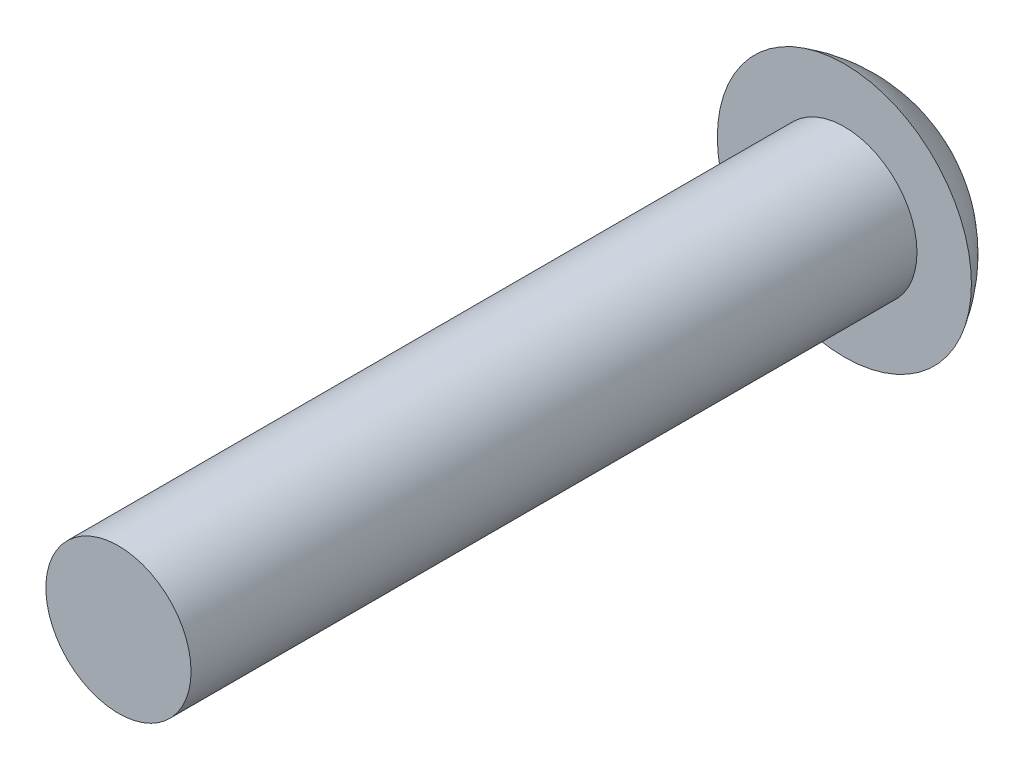
ISO-10303-21;
HEADER;
FILE_DESCRIPTION(('STEP AP214'),'2;1');
FILE_NAME('part.step','',(''),(''),'','','');
FILE_SCHEMA(('AUTOMOTIVE_DESIGN { 1 0 10303 214 1 1 1 1 }'));
ENDSEC;
DATA;
#1=APPLICATION_CONTEXT('core data for automotive mechanical design processes');
#2=APPLICATION_PROTOCOL_DEFINITION('international standard','automotive_design',2000,#1);
#3=PRODUCT_CONTEXT('',#1,'mechanical');
#4=PRODUCT('Part','Part','',(#3));
#5=PRODUCT_RELATED_PRODUCT_CATEGORY('part','',(#4));
#6=PRODUCT_DEFINITION_FORMATION('','',#4);
#7=PRODUCT_DEFINITION_CONTEXT('part definition',#1,'design');
#8=PRODUCT_DEFINITION('design','',#6,#7);
#9=PRODUCT_DEFINITION_SHAPE('','',#8);
#10=(LENGTH_UNIT() NAMED_UNIT(*) SI_UNIT(.MILLI.,.METRE.));
#11=(NAMED_UNIT(*) PLANE_ANGLE_UNIT() SI_UNIT($,.RADIAN.));
#12=(NAMED_UNIT(*) SI_UNIT($,.STERADIAN.) SOLID_ANGLE_UNIT());
#13=UNCERTAINTY_MEASURE_WITH_UNIT(LENGTH_MEASURE(1.E-05),#10,'distance_accuracy_value','');
#14=(GEOMETRIC_REPRESENTATION_CONTEXT(3) GLOBAL_UNCERTAINTY_ASSIGNED_CONTEXT((#13)) GLOBAL_UNIT_ASSIGNED_CONTEXT((#10,
#11,#12)) REPRESENTATION_CONTEXT('',''));
#15=CARTESIAN_POINT('',(0.,0.,0.));
#16=DIRECTION('',(0.,0.,1.));
#17=DIRECTION('',(1.,0.,0.));
#18=AXIS2_PLACEMENT_3D('',#15,#16,#17);
#19=CARTESIAN_POINT('',(0.,0.,-17.9375));
#20=DIRECTION('',(0.,0.,1.));
#21=DIRECTION('',(1.,0.,0.));
#22=AXIS2_PLACEMENT_3D('',#19,#20,#21);
#23=SPHERICAL_SURFACE('',#22,4.0625);
#24=CARTESIAN_POINT('',(0.,0.,-20.));
#25=DIRECTION('',(0.,0.,1.));
#26=DIRECTION('',(1.,0.,0.));
#27=AXIS2_PLACEMENT_3D('',#24,#25,#26);
#28=CIRCLE('',#27,3.5);
#29=CARTESIAN_POINT('',(3.5,0.,-20.));
#30=VERTEX_POINT('',#29);
#31=EDGE_CURVE('E341',#30,#30,#28,.T.);
#32=ORIENTED_EDGE('',*,*,#31,.F.);
#33=EDGE_LOOP('',(#32));
#34=FACE_BOUND('',#33,.T.);
#35=CARTESIAN_POINT('',(-0.1,0.,-17.9375));
#36=DIRECTION('',(1.,0.,0.));
#37=DIRECTION('',(0.,1.,0.));
#38=AXIS2_PLACEMENT_3D('',#35,#36,#37);
#39=CIRCLE('',#38,4.06126904427668);
#40=CARTESIAN_POINT('',(-0.1,-0.1,-21.9975377153421));
#41=VERTEX_POINT('',#40);
#42=CARTESIAN_POINT('',(-0.1,-2.,-21.4721720144873));
#43=VERTEX_POINT('',#42);
#44=EDGE_CURVE('E375',#41,#43,#39,.F.);
#45=ORIENTED_EDGE('',*,*,#44,.T.);
#46=CARTESIAN_POINT('',(0.,-2.,-17.9375));
#47=DIRECTION('',(0.,1.,0.));
#48=DIRECTION('',(0.,0.,1.));
#49=AXIS2_PLACEMENT_3D('',#46,#47,#48);
#50=CIRCLE('',#49,3.53608628995391);
#51=CARTESIAN_POINT('',(0.0999999999999998,-2.,-21.4721720144873));
#52=VERTEX_POINT('',#51);
#53=EDGE_CURVE('E12',#43,#52,#50,.F.);
#54=ORIENTED_EDGE('',*,*,#53,.T.);
#55=CARTESIAN_POINT('',(0.1,0.,-17.9375));
#56=DIRECTION('',(1.,0.,0.));
#57=DIRECTION('',(0.,1.,0.));
#58=AXIS2_PLACEMENT_3D('',#55,#56,#57);
#59=CIRCLE('',#58,4.06126904427668);
#60=CARTESIAN_POINT('',(0.1,-0.1,-21.9975377153421));
#61=VERTEX_POINT('',#60);
#62=EDGE_CURVE('E168',#61,#52,#59,.F.);
#63=ORIENTED_EDGE('',*,*,#62,.F.);
#64=CARTESIAN_POINT('',(0.,-0.1,-17.9375));
#65=DIRECTION('',(0.,1.,0.));
#66=DIRECTION('',(-1.,0.,0.));
#67=AXIS2_PLACEMENT_3D('',#64,#65,#66);
#68=CIRCLE('',#67,4.06126904427668);
#69=CARTESIAN_POINT('',(2.,-0.1,-21.4721720144873));
#70=VERTEX_POINT('',#69);
#71=EDGE_CURVE('E386',#61,#70,#68,.F.);
#72=ORIENTED_EDGE('',*,*,#71,.T.);
#73=CARTESIAN_POINT('',(2.,0.,-17.9375));
#74=DIRECTION('',(-1.,0.,0.));
#75=DIRECTION('',(0.,0.,1.));
#76=AXIS2_PLACEMENT_3D('',#73,#74,#75);
#77=CIRCLE('',#76,3.53608628995391);
#78=CARTESIAN_POINT('',(2.,0.0999999999999998,-21.4721720144873));
#79=VERTEX_POINT('',#78);
#80=EDGE_CURVE('E382',#70,#79,#77,.F.);
#81=ORIENTED_EDGE('',*,*,#80,.T.);
#82=CARTESIAN_POINT('',(0.,0.1,-17.9375));
#83=DIRECTION('',(0.,1.,0.));
#84=DIRECTION('',(-1.,0.,0.));
#85=AXIS2_PLACEMENT_3D('',#82,#83,#84);
#86=CIRCLE('',#85,4.06126904427668);
#87=CARTESIAN_POINT('',(0.1,0.1,-21.9975377153421));
#88=VERTEX_POINT('',#87);
#89=EDGE_CURVE('E379',#88,#79,#86,.F.);
#90=ORIENTED_EDGE('',*,*,#89,.F.);
#91=CARTESIAN_POINT('',(0.1,0.,-17.9375));
#92=DIRECTION('',(-1.,0.,0.));
#93=DIRECTION('',(0.,0.,1.));
#94=AXIS2_PLACEMENT_3D('',#91,#92,#93);
#95=CIRCLE('',#94,4.06126904427668);
#96=CARTESIAN_POINT('',(0.1,2.,-21.4721720144873));
#97=VERTEX_POINT('',#96);
#98=EDGE_CURVE('E371',#88,#97,#95,.F.);
#99=ORIENTED_EDGE('',*,*,#98,.T.);
#100=CARTESIAN_POINT('',(0.,2.,-17.9375));
#101=DIRECTION('',(0.,-1.,0.));
#102=DIRECTION('',(0.,0.,-1.));
#103=AXIS2_PLACEMENT_3D('',#100,#101,#102);
#104=CIRCLE('',#103,3.53608628995391);
#105=CARTESIAN_POINT('',(-0.1,2.,-21.4721720144873));
#106=VERTEX_POINT('',#105);
#107=EDGE_CURVE('E367',#97,#106,#104,.F.);
#108=ORIENTED_EDGE('',*,*,#107,.T.);
#109=CARTESIAN_POINT('',(-0.1,0.,-17.9375));
#110=DIRECTION('',(-1.,0.,0.));
#111=DIRECTION('',(0.,0.,1.));
#112=AXIS2_PLACEMENT_3D('',#109,#110,#111);
#113=CIRCLE('',#112,4.06126904427668);
#114=CARTESIAN_POINT('',(-0.1,0.1,-21.9975377153421));
#115=VERTEX_POINT('',#114);
#116=EDGE_CURVE('E364',#115,#106,#113,.F.);
#117=ORIENTED_EDGE('',*,*,#116,.F.);
#118=CARTESIAN_POINT('',(0.,0.1,-17.9375));
#119=DIRECTION('',(0.,-1.,0.));
#120=DIRECTION('',(0.,0.,-1.));
#121=AXIS2_PLACEMENT_3D('',#118,#119,#120);
#122=CIRCLE('',#121,4.06126904427668);
#123=CARTESIAN_POINT('',(-2.,0.1,-21.4721720144873));
#124=VERTEX_POINT('',#123);
#125=EDGE_CURVE('E360',#115,#124,#122,.F.);
#126=ORIENTED_EDGE('',*,*,#125,.T.);
#127=CARTESIAN_POINT('',(-2.,0.,-17.9375));
#128=DIRECTION('',(1.,0.,0.));
#129=DIRECTION('',(0.,0.,-1.));
#130=AXIS2_PLACEMENT_3D('',#127,#128,#129);
#131=CIRCLE('',#130,3.53608628995391);
#132=CARTESIAN_POINT('',(-2.,-0.1,-21.4721720144873));
#133=VERTEX_POINT('',#132);
#134=EDGE_CURVE('E356',#124,#133,#131,.F.);
#135=ORIENTED_EDGE('',*,*,#134,.T.);
#136=CARTESIAN_POINT('',(0.,-0.1,-17.9375));
#137=DIRECTION('',(0.,-1.,0.));
#138=DIRECTION('',(0.,0.,-1.));
#139=AXIS2_PLACEMENT_3D('',#136,#137,#138);
#140=CIRCLE('',#139,4.06126904427668);
#141=EDGE_CURVE('E353',#41,#133,#140,.F.);
#142=ORIENTED_EDGE('',*,*,#141,.F.);
#143=EDGE_LOOP('',(#45,#54,#63,#72,#81,#90,#99,#108,#117,#126,#135,#142));
#144=FACE_BOUND('',#143,.T.);
#145=ADVANCED_FACE('F159',(#34,#144),#23,.T.);
#146=CARTESIAN_POINT('',(0.,0.,-20.));
#147=DIRECTION('',(0.,0.,1.));
#148=DIRECTION('',(1.,0.,0.));
#149=AXIS2_PLACEMENT_3D('',#146,#147,#148);
#150=CYLINDRICAL_SURFACE('',#149,2.);
#151=CARTESIAN_POINT('',(0.,0.,-20.));
#152=DIRECTION('',(0.,0.,1.));
#153=DIRECTION('',(1.,0.,0.));
#154=AXIS2_PLACEMENT_3D('',#151,#152,#153);
#155=CIRCLE('',#154,2.);
#156=CARTESIAN_POINT('',(2.,0.,-20.));
#157=VERTEX_POINT('',#156);
#158=EDGE_CURVE('E345',#157,#157,#155,.F.);
#159=ORIENTED_EDGE('',*,*,#158,.F.);
#160=EDGE_LOOP('',(#159));
#161=FACE_BOUND('',#160,.T.);
#162=CARTESIAN_POINT('',(0.,0.,0.));
#163=DIRECTION('',(0.,0.,1.));
#164=DIRECTION('',(1.,0.,0.));
#165=AXIS2_PLACEMENT_3D('',#162,#163,#164);
#166=CIRCLE('',#165,2.);
#167=CARTESIAN_POINT('',(2.,0.,0.));
#168=VERTEX_POINT('',#167);
#169=EDGE_CURVE('E349',#168,#168,#166,.T.);
#170=ORIENTED_EDGE('',*,*,#169,.F.);
#171=EDGE_LOOP('',(#170));
#172=FACE_BOUND('',#171,.T.);
#173=ADVANCED_FACE('F161',(#161,#172),#150,.T.);
#174=CARTESIAN_POINT('',(0.,0.,0.));
#175=DIRECTION('',(0.,0.,1.));
#176=DIRECTION('',(1.,0.,0.));
#177=AXIS2_PLACEMENT_3D('',#174,#175,#176);
#178=PLANE('',#177);
#179=ORIENTED_EDGE('',*,*,#169,.T.);
#180=EDGE_LOOP('',(#179));
#181=FACE_BOUND('',#180,.T.);
#182=ADVANCED_FACE('F437',(#181),#178,.T.);
#183=CARTESIAN_POINT('',(3.5,0.,-20.));
#184=DIRECTION('',(0.,0.,1.));
#185=DIRECTION('',(1.,0.,0.));
#186=AXIS2_PLACEMENT_3D('',#183,#184,#185);
#187=PLANE('',#186);
#188=ORIENTED_EDGE('',*,*,#158,.T.);
#189=EDGE_LOOP('',(#188));
#190=FACE_BOUND('',#189,.T.);
#191=ORIENTED_EDGE('',*,*,#31,.T.);
#192=EDGE_LOOP('',(#191));
#193=FACE_BOUND('',#192,.T.);
#194=ADVANCED_FACE('F429',(#190,#193),#187,.T.);
#195=CARTESIAN_POINT('',(0.,0.,-21.4));
#196=DIRECTION('',(0.,0.,1.));
#197=DIRECTION('',(1.,0.,0.));
#198=AXIS2_PLACEMENT_3D('',#195,#196,#197);
#199=PLANE('',#198);
#200=DIRECTION('',(0.,1.,0.));
#201=VECTOR('',#200,1.);
#202=CARTESIAN_POINT('',(-0.1,0.,-21.4));
#203=LINE('',#202,#201);
#204=CARTESIAN_POINT('',(-0.1,0.1,-21.4));
#205=VERTEX_POINT('',#204);
#206=CARTESIAN_POINT('',(-0.1,2.,-21.4));
#207=VERTEX_POINT('',#206);
#208=EDGE_CURVE('E296',#205,#207,#203,.T.);
#209=ORIENTED_EDGE('',*,*,#208,.T.);
#210=DIRECTION('',(-1.,0.,0.));
#211=VECTOR('',#210,1.);
#212=CARTESIAN_POINT('',(0.1,2.,-21.4));
#213=LINE('',#212,#211);
#214=CARTESIAN_POINT('',(0.1,2.,-21.4));
#215=VERTEX_POINT('',#214);
#216=EDGE_CURVE('E299',#215,#207,#213,.T.);
#217=ORIENTED_EDGE('',*,*,#216,.F.);
#218=DIRECTION('',(0.,1.,0.));
#219=VECTOR('',#218,1.);
#220=CARTESIAN_POINT('',(0.1,0.,-21.4));
#221=LINE('',#220,#219);
#222=CARTESIAN_POINT('',(0.1,0.1,-21.4));
#223=VERTEX_POINT('',#222);
#224=EDGE_CURVE('E304',#223,#215,#221,.T.);
#225=ORIENTED_EDGE('',*,*,#224,.F.);
#226=DIRECTION('',(1.,0.,0.));
#227=VECTOR('',#226,1.);
#228=CARTESIAN_POINT('',(0.,0.1,-21.4));
#229=LINE('',#228,#227);
#230=CARTESIAN_POINT('',(2.,0.0999999999999998,-21.4));
#231=VERTEX_POINT('',#230);
#232=EDGE_CURVE('E278',#223,#231,#229,.T.);
#233=ORIENTED_EDGE('',*,*,#232,.T.);
#234=DIRECTION('',(0.,1.,0.));
#235=VECTOR('',#234,1.);
#236=CARTESIAN_POINT('',(2.,-0.1,-21.4));
#237=LINE('',#236,#235);
#238=CARTESIAN_POINT('',(2.,-0.1,-21.4));
#239=VERTEX_POINT('',#238);
#240=EDGE_CURVE('E281',#239,#231,#237,.T.);
#241=ORIENTED_EDGE('',*,*,#240,.F.);
#242=DIRECTION('',(1.,0.,0.));
#243=VECTOR('',#242,1.);
#244=CARTESIAN_POINT('',(0.,-0.1,-21.4));
#245=LINE('',#244,#243);
#246=CARTESIAN_POINT('',(0.1,-0.1,-21.4));
#247=VERTEX_POINT('',#246);
#248=EDGE_CURVE('E256',#247,#239,#245,.T.);
#249=ORIENTED_EDGE('',*,*,#248,.F.);
#250=DIRECTION('',(0.,-1.,0.));
#251=VECTOR('',#250,1.);
#252=CARTESIAN_POINT('',(0.1,0.,-21.4));
#253=LINE('',#252,#251);
#254=CARTESIAN_POINT('',(0.0999999999999998,-2.,-21.4));
#255=VERTEX_POINT('',#254);
#256=EDGE_CURVE('E250',#247,#255,#253,.T.);
#257=ORIENTED_EDGE('',*,*,#256,.T.);
#258=DIRECTION('',(1.,0.,0.));
#259=VECTOR('',#258,1.);
#260=CARTESIAN_POINT('',(-0.1,-2.,-21.4));
#261=LINE('',#260,#259);
#262=CARTESIAN_POINT('',(-0.1,-2.,-21.4));
#263=VERTEX_POINT('',#262);
#264=EDGE_CURVE('E254',#263,#255,#261,.T.);
#265=ORIENTED_EDGE('',*,*,#264,.F.);
#266=DIRECTION('',(0.,-1.,0.));
#267=VECTOR('',#266,1.);
#268=CARTESIAN_POINT('',(-0.1,0.,-21.4));
#269=LINE('',#268,#267);
#270=CARTESIAN_POINT('',(-0.1,-0.1,-21.4));
#271=VERTEX_POINT('',#270);
#272=EDGE_CURVE('E267',#271,#263,#269,.T.);
#273=ORIENTED_EDGE('',*,*,#272,.F.);
#274=DIRECTION('',(-1.,0.,0.));
#275=VECTOR('',#274,1.);
#276=CARTESIAN_POINT('',(0.,-0.1,-21.4));
#277=LINE('',#276,#275);
#278=CARTESIAN_POINT('',(-2.,-0.1,-21.4));
#279=VERTEX_POINT('',#278);
#280=EDGE_CURVE('E315',#271,#279,#277,.T.);
#281=ORIENTED_EDGE('',*,*,#280,.T.);
#282=DIRECTION('',(0.,-1.,0.));
#283=VECTOR('',#282,1.);
#284=CARTESIAN_POINT('',(-2.,0.1,-21.4));
#285=LINE('',#284,#283);
#286=CARTESIAN_POINT('',(-2.,0.1,-21.4));
#287=VERTEX_POINT('',#286);
#288=EDGE_CURVE('E318',#287,#279,#285,.T.);
#289=ORIENTED_EDGE('',*,*,#288,.F.);
#290=DIRECTION('',(-1.,0.,0.));
#291=VECTOR('',#290,1.);
#292=CARTESIAN_POINT('',(0.,0.1,-21.4));
#293=LINE('',#292,#291);
#294=EDGE_CURVE('E322',#205,#287,#293,.T.);
#295=ORIENTED_EDGE('',*,*,#294,.F.);
#296=EDGE_LOOP('',(#209,#217,#225,#233,#241,#249,#257,#265,#273,#281,#289,#295));
#297=FACE_BOUND('',#296,.T.);
#298=ADVANCED_FACE('F252',(#297),#199,.F.);
#299=CARTESIAN_POINT('',(-0.1,0.,-21.4));
#300=DIRECTION('',(1.,0.,0.));
#301=DIRECTION('',(0.,1.,0.));
#302=AXIS2_PLACEMENT_3D('',#299,#300,#301);
#303=PLANE('',#302);
#304=DIRECTION('',(0.,0.,-1.));
#305=VECTOR('',#304,1.);
#306=CARTESIAN_POINT('',(-0.1,-0.1,-21.4));
#307=LINE('',#306,#305);
#308=EDGE_CURVE('E175',#271,#41,#307,.T.);
#309=ORIENTED_EDGE('',*,*,#308,.F.);
#310=ORIENTED_EDGE('',*,*,#272,.T.);
#311=DIRECTION('',(0.,0.,-1.));
#312=VECTOR('',#311,1.);
#313=CARTESIAN_POINT('',(-0.1,-2.,-21.4));
#314=LINE('',#313,#312);
#315=EDGE_CURVE('E265',#263,#43,#314,.T.);
#316=ORIENTED_EDGE('',*,*,#315,.T.);
#317=ORIENTED_EDGE('',*,*,#44,.F.);
#318=EDGE_LOOP('',(#309,#310,#316,#317));
#319=FACE_BOUND('',#318,.T.);
#320=ADVANCED_FACE('F426',(#319),#303,.T.);
#321=CARTESIAN_POINT('',(-0.1,-2.,-21.4));
#322=DIRECTION('',(0.,1.,0.));
#323=DIRECTION('',(0.,0.,1.));
#324=AXIS2_PLACEMENT_3D('',#321,#322,#323);
#325=PLANE('',#324);
#326=ORIENTED_EDGE('',*,*,#315,.F.);
#327=ORIENTED_EDGE('',*,*,#264,.T.);
#328=DIRECTION('',(0.,0.,-1.));
#329=VECTOR('',#328,1.);
#330=CARTESIAN_POINT('',(0.0999999999999998,-2.,-21.4));
#331=LINE('',#330,#329);
#332=EDGE_CURVE('E264',#255,#52,#331,.T.);
#333=ORIENTED_EDGE('',*,*,#332,.T.);
#334=ORIENTED_EDGE('',*,*,#53,.F.);
#335=EDGE_LOOP('',(#326,#327,#333,#334));
#336=FACE_BOUND('',#335,.T.);
#337=ADVANCED_FACE('F263',(#336),#325,.T.);
#338=CARTESIAN_POINT('',(0.1,0.,-21.4));
#339=DIRECTION('',(1.,0.,0.));
#340=DIRECTION('',(0.,1.,0.));
#341=AXIS2_PLACEMENT_3D('',#338,#339,#340);
#342=PLANE('',#341);
#343=ORIENTED_EDGE('',*,*,#62,.T.);
#344=ORIENTED_EDGE('',*,*,#332,.F.);
#345=ORIENTED_EDGE('',*,*,#256,.F.);
#346=DIRECTION('',(0.,0.,1.));
#347=VECTOR('',#346,1.);
#348=CARTESIAN_POINT('',(0.1,-0.1,-21.4));
#349=LINE('',#348,#347);
#350=EDGE_CURVE('E338',#61,#247,#349,.T.);
#351=ORIENTED_EDGE('',*,*,#350,.F.);
#352=EDGE_LOOP('',(#343,#344,#345,#351));
#353=FACE_BOUND('',#352,.T.);
#354=ADVANCED_FACE('F269',(#353),#342,.F.);
#355=CARTESIAN_POINT('',(0.1,0.,-21.4));
#356=DIRECTION('',(-1.,0.,0.));
#357=DIRECTION('',(0.,0.,1.));
#358=AXIS2_PLACEMENT_3D('',#355,#356,#357);
#359=PLANE('',#358);
#360=DIRECTION('',(0.,0.,1.));
#361=VECTOR('',#360,1.);
#362=CARTESIAN_POINT('',(0.1,0.1,-21.4));
#363=LINE('',#362,#361);
#364=EDGE_CURVE('E261',#88,#223,#363,.T.);
#365=ORIENTED_EDGE('',*,*,#364,.T.);
#366=ORIENTED_EDGE('',*,*,#224,.T.);
#367=DIRECTION('',(0.,0.,-1.));
#368=VECTOR('',#367,1.);
#369=CARTESIAN_POINT('',(0.1,2.,-21.4));
#370=LINE('',#369,#368);
#371=EDGE_CURVE('E308',#215,#97,#370,.T.);
#372=ORIENTED_EDGE('',*,*,#371,.T.);
#373=ORIENTED_EDGE('',*,*,#98,.F.);
#374=EDGE_LOOP('',(#365,#366,#372,#373));
#375=FACE_BOUND('',#374,.T.);
#376=ADVANCED_FACE('F406',(#375),#359,.T.);
#377=CARTESIAN_POINT('',(0.1,2.,-21.4));
#378=DIRECTION('',(0.,-1.,0.));
#379=DIRECTION('',(0.,0.,-1.));
#380=AXIS2_PLACEMENT_3D('',#377,#378,#379);
#381=PLANE('',#380);
#382=ORIENTED_EDGE('',*,*,#371,.F.);
#383=ORIENTED_EDGE('',*,*,#216,.T.);
#384=DIRECTION('',(0.,0.,-1.));
#385=VECTOR('',#384,1.);
#386=CARTESIAN_POINT('',(-0.1,2.,-21.4));
#387=LINE('',#386,#385);
#388=EDGE_CURVE('E307',#207,#106,#387,.T.);
#389=ORIENTED_EDGE('',*,*,#388,.T.);
#390=ORIENTED_EDGE('',*,*,#107,.F.);
#391=EDGE_LOOP('',(#382,#383,#389,#390));
#392=FACE_BOUND('',#391,.T.);
#393=ADVANCED_FACE('F409',(#392),#381,.T.);
#394=CARTESIAN_POINT('',(-0.1,0.,-21.4));
#395=DIRECTION('',(-1.,0.,0.));
#396=DIRECTION('',(0.,0.,1.));
#397=AXIS2_PLACEMENT_3D('',#394,#395,#396);
#398=PLANE('',#397);
#399=ORIENTED_EDGE('',*,*,#116,.T.);
#400=ORIENTED_EDGE('',*,*,#388,.F.);
#401=ORIENTED_EDGE('',*,*,#208,.F.);
#402=DIRECTION('',(0.,0.,1.));
#403=VECTOR('',#402,1.);
#404=CARTESIAN_POINT('',(-0.1,0.1,-21.4));
#405=LINE('',#404,#403);
#406=EDGE_CURVE('E282',#115,#205,#405,.T.);
#407=ORIENTED_EDGE('',*,*,#406,.F.);
#408=EDGE_LOOP('',(#399,#400,#401,#407));
#409=FACE_BOUND('',#408,.T.);
#410=ADVANCED_FACE('F416',(#409),#398,.F.);
#411=CARTESIAN_POINT('',(0.,-0.1,-21.4));
#412=DIRECTION('',(0.,1.,0.));
#413=DIRECTION('',(-1.,0.,0.));
#414=AXIS2_PLACEMENT_3D('',#411,#412,#413);
#415=PLANE('',#414);
#416=ORIENTED_EDGE('',*,*,#350,.T.);
#417=ORIENTED_EDGE('',*,*,#248,.T.);
#418=DIRECTION('',(0.,0.,-1.));
#419=VECTOR('',#418,1.);
#420=CARTESIAN_POINT('',(2.,-0.1,-21.4));
#421=LINE('',#420,#419);
#422=EDGE_CURVE('E289',#239,#70,#421,.T.);
#423=ORIENTED_EDGE('',*,*,#422,.T.);
#424=ORIENTED_EDGE('',*,*,#71,.F.);
#425=EDGE_LOOP('',(#416,#417,#423,#424));
#426=FACE_BOUND('',#425,.T.);
#427=ADVANCED_FACE('F393',(#426),#415,.T.);
#428=CARTESIAN_POINT('',(2.,-0.1,-21.4));
#429=DIRECTION('',(-1.,0.,0.));
#430=DIRECTION('',(0.,0.,1.));
#431=AXIS2_PLACEMENT_3D('',#428,#429,#430);
#432=PLANE('',#431);
#433=ORIENTED_EDGE('',*,*,#422,.F.);
#434=ORIENTED_EDGE('',*,*,#240,.T.);
#435=DIRECTION('',(0.,0.,-1.));
#436=VECTOR('',#435,1.);
#437=CARTESIAN_POINT('',(2.,0.0999999999999998,-21.4));
#438=LINE('',#437,#436);
#439=EDGE_CURVE('E288',#231,#79,#438,.T.);
#440=ORIENTED_EDGE('',*,*,#439,.T.);
#441=ORIENTED_EDGE('',*,*,#80,.F.);
#442=EDGE_LOOP('',(#433,#434,#440,#441));
#443=FACE_BOUND('',#442,.T.);
#444=ADVANCED_FACE('F396',(#443),#432,.T.);
#445=CARTESIAN_POINT('',(0.,0.1,-21.4));
#446=DIRECTION('',(0.,1.,0.));
#447=DIRECTION('',(-1.,0.,0.));
#448=AXIS2_PLACEMENT_3D('',#445,#446,#447);
#449=PLANE('',#448);
#450=ORIENTED_EDGE('',*,*,#89,.T.);
#451=ORIENTED_EDGE('',*,*,#439,.F.);
#452=ORIENTED_EDGE('',*,*,#232,.F.);
#453=ORIENTED_EDGE('',*,*,#364,.F.);
#454=EDGE_LOOP('',(#450,#451,#452,#453));
#455=FACE_BOUND('',#454,.T.);
#456=ADVANCED_FACE('F403',(#455),#449,.F.);
#457=CARTESIAN_POINT('',(0.,0.1,-21.4));
#458=DIRECTION('',(0.,-1.,0.));
#459=DIRECTION('',(0.,0.,-1.));
#460=AXIS2_PLACEMENT_3D('',#457,#458,#459);
#461=PLANE('',#460);
#462=ORIENTED_EDGE('',*,*,#406,.T.);
#463=ORIENTED_EDGE('',*,*,#294,.T.);
#464=DIRECTION('',(0.,0.,-1.));
#465=VECTOR('',#464,1.);
#466=CARTESIAN_POINT('',(-2.,0.1,-21.4));
#467=LINE('',#466,#465);
#468=EDGE_CURVE('E300',#287,#124,#467,.T.);
#469=ORIENTED_EDGE('',*,*,#468,.T.);
#470=ORIENTED_EDGE('',*,*,#125,.F.);
#471=EDGE_LOOP('',(#462,#463,#469,#470));
#472=FACE_BOUND('',#471,.T.);
#473=ADVANCED_FACE('F419',(#472),#461,.T.);
#474=CARTESIAN_POINT('',(-2.,0.1,-21.4));
#475=DIRECTION('',(1.,0.,0.));
#476=DIRECTION('',(0.,0.,-1.));
#477=AXIS2_PLACEMENT_3D('',#474,#475,#476);
#478=PLANE('',#477);
#479=ORIENTED_EDGE('',*,*,#468,.F.);
#480=ORIENTED_EDGE('',*,*,#288,.T.);
#481=DIRECTION('',(0.,0.,-1.));
#482=VECTOR('',#481,1.);
#483=CARTESIAN_POINT('',(-2.,-0.1,-21.4));
#484=LINE('',#483,#482);
#485=EDGE_CURVE('E325',#279,#133,#484,.T.);
#486=ORIENTED_EDGE('',*,*,#485,.T.);
#487=ORIENTED_EDGE('',*,*,#134,.F.);
#488=EDGE_LOOP('',(#479,#480,#486,#487));
#489=FACE_BOUND('',#488,.T.);
#490=ADVANCED_FACE('F422',(#489),#478,.T.);
#491=CARTESIAN_POINT('',(0.,-0.1,-21.4));
#492=DIRECTION('',(0.,-1.,0.));
#493=DIRECTION('',(0.,0.,-1.));
#494=AXIS2_PLACEMENT_3D('',#491,#492,#493);
#495=PLANE('',#494);
#496=ORIENTED_EDGE('',*,*,#141,.T.);
#497=ORIENTED_EDGE('',*,*,#485,.F.);
#498=ORIENTED_EDGE('',*,*,#280,.F.);
#499=ORIENTED_EDGE('',*,*,#308,.T.);
#500=EDGE_LOOP('',(#496,#497,#498,#499));
#501=FACE_BOUND('',#500,.T.);
#502=ADVANCED_FACE('F424',(#501),#495,.F.);
#503=CLOSED_SHELL('',(#145,#173,#182,#194,#298,#320,#337,#354,#376,#393,#410,#427,#444,#456,
#473,#490,#502));
#504=MANIFOLD_SOLID_BREP('B2',#503);
#505=ADVANCED_BREP_SHAPE_REPRESENTATION('',(#18,#504),#14);
#506=SHAPE_DEFINITION_REPRESENTATION(#9,#505);
ENDSEC;
END-ISO-10303-21;
